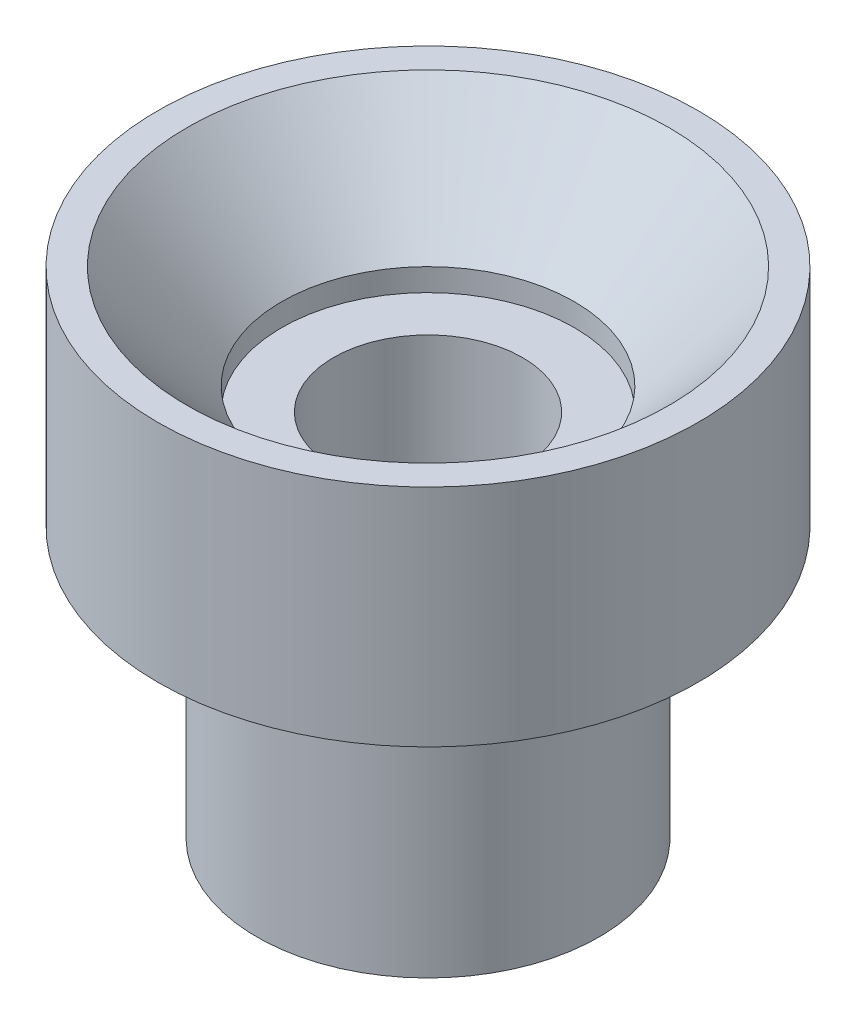
ISO-10303-21;
HEADER;
FILE_DESCRIPTION(('STEP AP214'),'2;1');
FILE_NAME('part.step','',(''),(''),'','','');
FILE_SCHEMA(('AUTOMOTIVE_DESIGN { 1 0 10303 214 1 1 1 1 }'));
ENDSEC;
DATA;
#1=APPLICATION_CONTEXT('core data for automotive mechanical design processes');
#2=APPLICATION_PROTOCOL_DEFINITION('international standard','automotive_design',2000,#1);
#3=PRODUCT_CONTEXT('',#1,'mechanical');
#4=PRODUCT('Part','Part','',(#3));
#5=PRODUCT_RELATED_PRODUCT_CATEGORY('part','',(#4));
#6=PRODUCT_DEFINITION_FORMATION('','',#4);
#7=PRODUCT_DEFINITION_CONTEXT('part definition',#1,'design');
#8=PRODUCT_DEFINITION('design','',#6,#7);
#9=PRODUCT_DEFINITION_SHAPE('','',#8);
#10=(LENGTH_UNIT() NAMED_UNIT(*) SI_UNIT(.MILLI.,.METRE.));
#11=(NAMED_UNIT(*) PLANE_ANGLE_UNIT() SI_UNIT($,.RADIAN.));
#12=(NAMED_UNIT(*) SI_UNIT($,.STERADIAN.) SOLID_ANGLE_UNIT());
#13=UNCERTAINTY_MEASURE_WITH_UNIT(LENGTH_MEASURE(1.E-05),#10,'distance_accuracy_value','');
#14=(GEOMETRIC_REPRESENTATION_CONTEXT(3) GLOBAL_UNCERTAINTY_ASSIGNED_CONTEXT((#13)) GLOBAL_UNIT_ASSIGNED_CONTEXT((#10,
#11,#12)) REPRESENTATION_CONTEXT('',''));
#15=CARTESIAN_POINT('',(0.,0.,0.));
#16=DIRECTION('',(0.,0.,1.));
#17=DIRECTION('',(1.,0.,0.));
#18=AXIS2_PLACEMENT_3D('',#15,#16,#17);
#19=CARTESIAN_POINT('',(0.,0.,0.));
#20=DIRECTION('',(0.,-1.,0.));
#21=DIRECTION('',(0.,0.,-1.));
#22=AXIS2_PLACEMENT_3D('',#19,#20,#21);
#23=CYLINDRICAL_SURFACE('',#22,3.25);
#24=CARTESIAN_POINT('',(0.,8.2,0.));
#25=DIRECTION('',(0.,-1.,0.));
#26=DIRECTION('',(0.,0.,-1.));
#27=AXIS2_PLACEMENT_3D('',#24,#25,#26);
#28=CIRCLE('',#27,3.25);
#29=CARTESIAN_POINT('',(0.,8.2,-3.25));
#30=VERTEX_POINT('',#29);
#31=EDGE_CURVE('E76',#30,#30,#28,.T.);
#32=ORIENTED_EDGE('',*,*,#31,.T.);
#33=EDGE_LOOP('',(#32));
#34=FACE_BOUND('',#33,.T.);
#35=CARTESIAN_POINT('',(0.,8.7,0.));
#36=DIRECTION('',(0.,-1.,0.));
#37=DIRECTION('',(0.,0.,-1.));
#38=AXIS2_PLACEMENT_3D('',#35,#36,#37);
#39=CIRCLE('',#38,3.25);
#40=CARTESIAN_POINT('',(0.,8.7,-3.25));
#41=VERTEX_POINT('',#40);
#42=EDGE_CURVE('E10',#41,#41,#39,.T.);
#43=ORIENTED_EDGE('',*,*,#42,.F.);
#44=EDGE_LOOP('',(#43));
#45=FACE_BOUND('',#44,.T.);
#46=ADVANCED_FACE('F37',(#34,#45),#23,.F.);
#47=CARTESIAN_POINT('',(0.,11.,0.));
#48=DIRECTION('',(0.,1.,0.));
#49=DIRECTION('',(0.,0.,1.));
#50=AXIS2_PLACEMENT_3D('',#47,#48,#49);
#51=CONICAL_SURFACE('',#50,5.35,0.739974883975871);
#52=ORIENTED_EDGE('',*,*,#42,.T.);
#53=EDGE_LOOP('',(#52));
#54=FACE_BOUND('',#53,.T.);
#55=CARTESIAN_POINT('',(0.,11.,0.));
#56=DIRECTION('',(0.,-1.,0.));
#57=DIRECTION('',(0.,0.,-1.));
#58=AXIS2_PLACEMENT_3D('',#55,#56,#57);
#59=CIRCLE('',#58,5.35);
#60=CARTESIAN_POINT('',(0.,11.,-5.35));
#61=VERTEX_POINT('',#60);
#62=EDGE_CURVE('E44',#61,#61,#59,.T.);
#63=ORIENTED_EDGE('',*,*,#62,.F.);
#64=EDGE_LOOP('',(#63));
#65=FACE_BOUND('',#64,.T.);
#66=ADVANCED_FACE('F95',(#54,#65),#51,.F.);
#67=CARTESIAN_POINT('',(5.35,11.,0.));
#68=DIRECTION('',(0.,1.,0.));
#69=DIRECTION('',(0.,0.,1.));
#70=AXIS2_PLACEMENT_3D('',#67,#68,#69);
#71=PLANE('',#70);
#72=ORIENTED_EDGE('',*,*,#62,.T.);
#73=EDGE_LOOP('',(#72));
#74=FACE_BOUND('',#73,.T.);
#75=CARTESIAN_POINT('',(0.,11.,0.));
#76=DIRECTION('',(0.,-1.,0.));
#77=DIRECTION('',(0.,0.,-1.));
#78=AXIS2_PLACEMENT_3D('',#75,#76,#77);
#79=CIRCLE('',#78,6.);
#80=CARTESIAN_POINT('',(0.,11.,-6.));
#81=VERTEX_POINT('',#80);
#82=EDGE_CURVE('E49',#81,#81,#79,.T.);
#83=ORIENTED_EDGE('',*,*,#82,.F.);
#84=EDGE_LOOP('',(#83));
#85=FACE_BOUND('',#84,.T.);
#86=ADVANCED_FACE('F99',(#74,#85),#71,.T.);
#87=CARTESIAN_POINT('',(0.,0.,0.));
#88=DIRECTION('',(0.,-1.,0.));
#89=DIRECTION('',(0.,0.,-1.));
#90=AXIS2_PLACEMENT_3D('',#87,#88,#89);
#91=CYLINDRICAL_SURFACE('',#90,6.);
#92=ORIENTED_EDGE('',*,*,#82,.T.);
#93=EDGE_LOOP('',(#92));
#94=FACE_BOUND('',#93,.T.);
#95=CARTESIAN_POINT('',(0.,6.,0.));
#96=DIRECTION('',(0.,-1.,0.));
#97=DIRECTION('',(0.,0.,-1.));
#98=AXIS2_PLACEMENT_3D('',#95,#96,#97);
#99=CIRCLE('',#98,6.);
#100=CARTESIAN_POINT('',(0.,6.,-6.));
#101=VERTEX_POINT('',#100);
#102=EDGE_CURVE('E54',#101,#101,#99,.T.);
#103=ORIENTED_EDGE('',*,*,#102,.F.);
#104=EDGE_LOOP('',(#103));
#105=FACE_BOUND('',#104,.T.);
#106=ADVANCED_FACE('F103',(#94,#105),#91,.T.);
#107=CARTESIAN_POINT('',(6.,6.,0.));
#108=DIRECTION('',(0.,-1.,0.));
#109=DIRECTION('',(0.,0.,-1.));
#110=AXIS2_PLACEMENT_3D('',#107,#108,#109);
#111=PLANE('',#110);
#112=ORIENTED_EDGE('',*,*,#102,.T.);
#113=EDGE_LOOP('',(#112));
#114=FACE_BOUND('',#113,.T.);
#115=CARTESIAN_POINT('',(0.,6.,0.));
#116=DIRECTION('',(0.,-1.,0.));
#117=DIRECTION('',(0.,0.,-1.));
#118=AXIS2_PLACEMENT_3D('',#115,#116,#117);
#119=CIRCLE('',#118,3.8);
#120=CARTESIAN_POINT('',(0.,6.,-3.8));
#121=VERTEX_POINT('',#120);
#122=EDGE_CURVE('E60',#121,#121,#119,.T.);
#123=ORIENTED_EDGE('',*,*,#122,.F.);
#124=EDGE_LOOP('',(#123));
#125=FACE_BOUND('',#124,.T.);
#126=ADVANCED_FACE('F109',(#114,#125),#111,.T.);
#127=CARTESIAN_POINT('',(0.,0.,0.));
#128=DIRECTION('',(0.,-1.,0.));
#129=DIRECTION('',(0.,0.,-1.));
#130=AXIS2_PLACEMENT_3D('',#127,#128,#129);
#131=CYLINDRICAL_SURFACE('',#130,3.8);
#132=ORIENTED_EDGE('',*,*,#122,.T.);
#133=EDGE_LOOP('',(#132));
#134=FACE_BOUND('',#133,.T.);
#135=CARTESIAN_POINT('',(0.,0.,0.));
#136=DIRECTION('',(0.,-1.,0.));
#137=DIRECTION('',(0.,0.,-1.));
#138=AXIS2_PLACEMENT_3D('',#135,#136,#137);
#139=CIRCLE('',#138,3.8);
#140=CARTESIAN_POINT('',(0.,0.,-3.8));
#141=VERTEX_POINT('',#140);
#142=EDGE_CURVE('E64',#141,#141,#139,.T.);
#143=ORIENTED_EDGE('',*,*,#142,.F.);
#144=EDGE_LOOP('',(#143));
#145=FACE_BOUND('',#144,.T.);
#146=ADVANCED_FACE('F113',(#134,#145),#131,.T.);
#147=CARTESIAN_POINT('',(3.8,0.,0.));
#148=DIRECTION('',(0.,-1.,0.));
#149=DIRECTION('',(0.,0.,-1.));
#150=AXIS2_PLACEMENT_3D('',#147,#148,#149);
#151=PLANE('',#150);
#152=ORIENTED_EDGE('',*,*,#142,.T.);
#153=EDGE_LOOP('',(#152));
#154=FACE_BOUND('',#153,.T.);
#155=CARTESIAN_POINT('',(0.,0.,0.));
#156=DIRECTION('',(0.,-1.,0.));
#157=DIRECTION('',(0.,0.,-1.));
#158=AXIS2_PLACEMENT_3D('',#155,#156,#157);
#159=CIRCLE('',#158,2.1);
#160=CARTESIAN_POINT('',(0.,0.,-2.1));
#161=VERTEX_POINT('',#160);
#162=EDGE_CURVE('E68',#161,#161,#159,.T.);
#163=ORIENTED_EDGE('',*,*,#162,.F.);
#164=EDGE_LOOP('',(#163));
#165=FACE_BOUND('',#164,.T.);
#166=ADVANCED_FACE('F91',(#154,#165),#151,.T.);
#167=CARTESIAN_POINT('',(0.,0.,0.));
#168=DIRECTION('',(0.,-1.,0.));
#169=DIRECTION('',(0.,0.,-1.));
#170=AXIS2_PLACEMENT_3D('',#167,#168,#169);
#171=CYLINDRICAL_SURFACE('',#170,2.1);
#172=ORIENTED_EDGE('',*,*,#162,.T.);
#173=EDGE_LOOP('',(#172));
#174=FACE_BOUND('',#173,.T.);
#175=CARTESIAN_POINT('',(0.,8.2,0.));
#176=DIRECTION('',(0.,-1.,0.));
#177=DIRECTION('',(0.,0.,-1.));
#178=AXIS2_PLACEMENT_3D('',#175,#176,#177);
#179=CIRCLE('',#178,2.1);
#180=CARTESIAN_POINT('',(0.,8.2,-2.1));
#181=VERTEX_POINT('',#180);
#182=EDGE_CURVE('E72',#181,#181,#179,.T.);
#183=ORIENTED_EDGE('',*,*,#182,.F.);
#184=EDGE_LOOP('',(#183));
#185=FACE_BOUND('',#184,.T.);
#186=ADVANCED_FACE('F85',(#174,#185),#171,.F.);
#187=CARTESIAN_POINT('',(3.25,8.2,0.));
#188=DIRECTION('',(0.,1.,0.));
#189=DIRECTION('',(0.,0.,1.));
#190=AXIS2_PLACEMENT_3D('',#187,#188,#189);
#191=PLANE('',#190);
#192=ORIENTED_EDGE('',*,*,#182,.T.);
#193=EDGE_LOOP('',(#192));
#194=FACE_BOUND('',#193,.T.);
#195=ORIENTED_EDGE('',*,*,#31,.F.);
#196=EDGE_LOOP('',(#195));
#197=FACE_BOUND('',#196,.T.);
#198=ADVANCED_FACE('F83',(#194,#197),#191,.T.);
#199=CLOSED_SHELL('',(#46,#66,#86,#106,#126,#146,#166,#186,#198));
#200=MANIFOLD_SOLID_BREP('B2',#199);
#201=ADVANCED_BREP_SHAPE_REPRESENTATION('',(#18,#200),#14);
#202=SHAPE_DEFINITION_REPRESENTATION(#9,#201);
ENDSEC;
END-ISO-10303-21;
